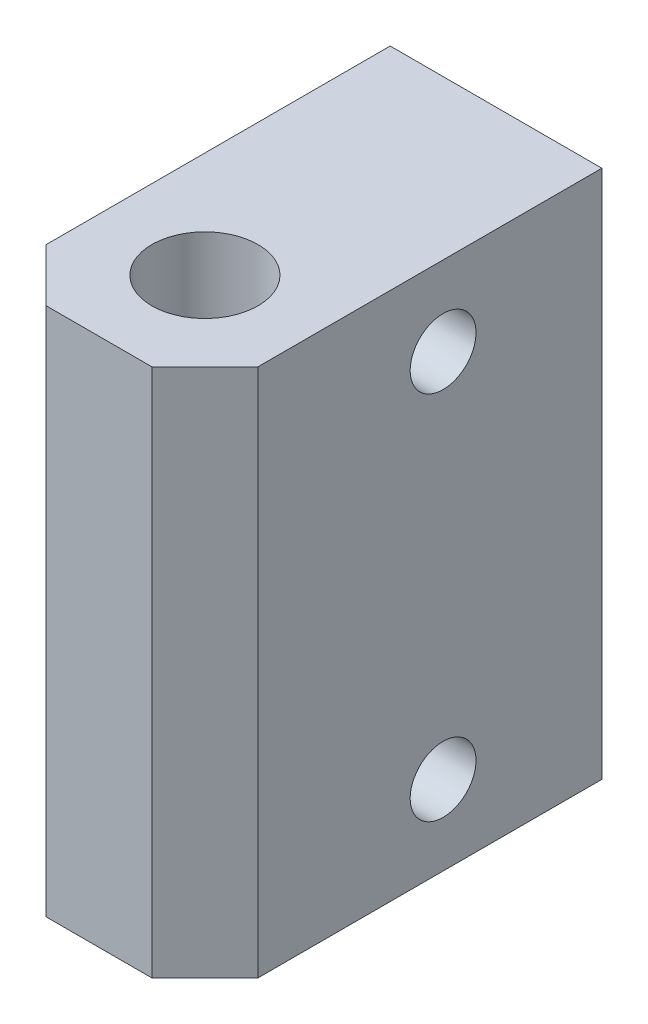
ISO-10303-21;
HEADER;
FILE_DESCRIPTION(('STEP AP214'),'2;1');
FILE_NAME('part.step','',(''),(''),'','','');
FILE_SCHEMA(('AUTOMOTIVE_DESIGN { 1 0 10303 214 1 1 1 1 }'));
ENDSEC;
DATA;
#1=APPLICATION_CONTEXT('core data for automotive mechanical design processes');
#2=APPLICATION_PROTOCOL_DEFINITION('international standard','automotive_design',2000,#1);
#3=PRODUCT_CONTEXT('',#1,'mechanical');
#4=PRODUCT('Part','Part','',(#3));
#5=PRODUCT_RELATED_PRODUCT_CATEGORY('part','',(#4));
#6=PRODUCT_DEFINITION_FORMATION('','',#4);
#7=PRODUCT_DEFINITION_CONTEXT('part definition',#1,'design');
#8=PRODUCT_DEFINITION('design','',#6,#7);
#9=PRODUCT_DEFINITION_SHAPE('','',#8);
#10=(LENGTH_UNIT() NAMED_UNIT(*) SI_UNIT(.MILLI.,.METRE.));
#11=(NAMED_UNIT(*) PLANE_ANGLE_UNIT() SI_UNIT($,.RADIAN.));
#12=(NAMED_UNIT(*) SI_UNIT($,.STERADIAN.) SOLID_ANGLE_UNIT());
#13=UNCERTAINTY_MEASURE_WITH_UNIT(LENGTH_MEASURE(1.E-05),#10,'distance_accuracy_value','');
#14=(GEOMETRIC_REPRESENTATION_CONTEXT(3) GLOBAL_UNCERTAINTY_ASSIGNED_CONTEXT((#13)) GLOBAL_UNIT_ASSIGNED_CONTEXT((#10,
#11,#12)) REPRESENTATION_CONTEXT('',''));
#15=CARTESIAN_POINT('',(0.,0.,0.));
#16=DIRECTION('',(0.,0.,1.));
#17=DIRECTION('',(1.,0.,0.));
#18=AXIS2_PLACEMENT_3D('',#15,#16,#17);
#19=CARTESIAN_POINT('',(8.,40.,8.));
#20=DIRECTION('',(-1.,0.,0.));
#21=DIRECTION('',(0.,0.,1.));
#22=AXIS2_PLACEMENT_3D('',#19,#20,#21);
#23=PLANE('',#22);
#24=CARTESIAN_POINT('',(8.,34.,-10.));
#25=DIRECTION('',(-1.,0.,0.));
#26=DIRECTION('',(0.,0.,1.));
#27=AXIS2_PLACEMENT_3D('',#24,#25,#26);
#28=CIRCLE('',#27,2.4892);
#29=CARTESIAN_POINT('',(8.,34.,-7.51080000000001));
#30=VERTEX_POINT('',#29);
#31=EDGE_CURVE('E268',#30,#30,#28,.T.);
#32=ORIENTED_EDGE('',*,*,#31,.T.);
#33=EDGE_LOOP('',(#32));
#34=FACE_BOUND('',#33,.T.);
#35=CARTESIAN_POINT('',(8.,6.,-10.));
#36=DIRECTION('',(-1.,0.,0.));
#37=DIRECTION('',(0.,0.,1.));
#38=AXIS2_PLACEMENT_3D('',#35,#36,#37);
#39=CIRCLE('',#38,2.4892);
#40=CARTESIAN_POINT('',(8.,6.,-7.51080000000001));
#41=VERTEX_POINT('',#40);
#42=EDGE_CURVE('E106',#41,#41,#39,.T.);
#43=ORIENTED_EDGE('',*,*,#42,.T.);
#44=EDGE_LOOP('',(#43));
#45=FACE_BOUND('',#44,.T.);
#46=DIRECTION('',(0.,0.,-1.));
#47=VECTOR('',#46,1.);
#48=CARTESIAN_POINT('',(8.,40.,8.));
#49=LINE('',#48,#47);
#50=CARTESIAN_POINT('',(8.,40.,3.99999999999999));
#51=VERTEX_POINT('',#50);
#52=CARTESIAN_POINT('',(8.,40.,-22.));
#53=VERTEX_POINT('',#52);
#54=EDGE_CURVE('E110',#51,#53,#49,.T.);
#55=ORIENTED_EDGE('',*,*,#54,.F.);
#56=DIRECTION('',(0.,-1.,0.));
#57=VECTOR('',#56,1.);
#58=CARTESIAN_POINT('',(8.,40.,3.99999999999999));
#59=LINE('',#58,#57);
#60=CARTESIAN_POINT('',(8.,0.,3.99999999999999));
#61=VERTEX_POINT('',#60);
#62=EDGE_CURVE('E129',#51,#61,#59,.T.);
#63=ORIENTED_EDGE('',*,*,#62,.T.);
#64=DIRECTION('',(0.,0.,-1.));
#65=VECTOR('',#64,1.);
#66=CARTESIAN_POINT('',(8.,0.,8.));
#67=LINE('',#66,#65);
#68=CARTESIAN_POINT('',(8.,0.,-22.));
#69=VERTEX_POINT('',#68);
#70=EDGE_CURVE('E100',#61,#69,#67,.T.);
#71=ORIENTED_EDGE('',*,*,#70,.T.);
#72=DIRECTION('',(0.,-1.,0.));
#73=VECTOR('',#72,1.);
#74=CARTESIAN_POINT('',(8.,40.,-22.));
#75=LINE('',#74,#73);
#76=EDGE_CURVE('E126',#53,#69,#75,.T.);
#77=ORIENTED_EDGE('',*,*,#76,.F.);
#78=EDGE_LOOP('',(#55,#63,#71,#77));
#79=FACE_BOUND('',#78,.T.);
#80=ADVANCED_FACE('F34',(#34,#45,#79),#23,.F.);
#81=CARTESIAN_POINT('',(-8.,40.,-22.));
#82=DIRECTION('',(0.,0.,1.));
#83=DIRECTION('',(1.,0.,0.));
#84=AXIS2_PLACEMENT_3D('',#81,#82,#83);
#85=PLANE('',#84);
#86=DIRECTION('',(-1.,0.,0.));
#87=VECTOR('',#86,1.);
#88=CARTESIAN_POINT('',(-8.,0.,-22.));
#89=LINE('',#88,#87);
#90=CARTESIAN_POINT('',(-8.,0.,-22.));
#91=VERTEX_POINT('',#90);
#92=EDGE_CURVE('E103',#69,#91,#89,.T.);
#93=ORIENTED_EDGE('',*,*,#92,.T.);
#94=DIRECTION('',(0.,-1.,0.));
#95=VECTOR('',#94,1.);
#96=CARTESIAN_POINT('',(-8.,40.,-22.));
#97=LINE('',#96,#95);
#98=CARTESIAN_POINT('',(-8.,40.,-22.));
#99=VERTEX_POINT('',#98);
#100=EDGE_CURVE('E118',#99,#91,#97,.T.);
#101=ORIENTED_EDGE('',*,*,#100,.F.);
#102=DIRECTION('',(-1.,0.,0.));
#103=VECTOR('',#102,1.);
#104=CARTESIAN_POINT('',(-8.,40.,-22.));
#105=LINE('',#104,#103);
#106=EDGE_CURVE('E112',#53,#99,#105,.T.);
#107=ORIENTED_EDGE('',*,*,#106,.F.);
#108=ORIENTED_EDGE('',*,*,#76,.T.);
#109=EDGE_LOOP('',(#93,#101,#107,#108));
#110=FACE_BOUND('',#109,.T.);
#111=ADVANCED_FACE('F163',(#110),#85,.F.);
#112=CARTESIAN_POINT('',(-8.,40.,8.));
#113=DIRECTION('',(1.,0.,0.));
#114=DIRECTION('',(0.,0.,-1.));
#115=AXIS2_PLACEMENT_3D('',#112,#113,#114);
#116=PLANE('',#115);
#117=CARTESIAN_POINT('',(-8.,34.,-10.));
#118=DIRECTION('',(-1.,0.,0.));
#119=DIRECTION('',(0.,0.,1.));
#120=AXIS2_PLACEMENT_3D('',#117,#118,#119);
#121=CIRCLE('',#120,2.48919999999999);
#122=CARTESIAN_POINT('',(-8.,34.,-7.51080000000001));
#123=VERTEX_POINT('',#122);
#124=EDGE_CURVE('E271',#123,#123,#121,.T.);
#125=ORIENTED_EDGE('',*,*,#124,.F.);
#126=EDGE_LOOP('',(#125));
#127=FACE_BOUND('',#126,.T.);
#128=CARTESIAN_POINT('',(-8.,6.,-10.));
#129=DIRECTION('',(-1.,0.,0.));
#130=DIRECTION('',(0.,0.,1.));
#131=AXIS2_PLACEMENT_3D('',#128,#129,#130);
#132=CIRCLE('',#131,2.48919999999999);
#133=CARTESIAN_POINT('',(-8.,6.,-7.51080000000001));
#134=VERTEX_POINT('',#133);
#135=EDGE_CURVE('E273',#134,#134,#132,.T.);
#136=ORIENTED_EDGE('',*,*,#135,.F.);
#137=EDGE_LOOP('',(#136));
#138=FACE_BOUND('',#137,.T.);
#139=DIRECTION('',(0.,0.,1.));
#140=VECTOR('',#139,1.);
#141=CARTESIAN_POINT('',(-8.,0.,8.));
#142=LINE('',#141,#140);
#143=CARTESIAN_POINT('',(-8.,0.,3.99999999999998));
#144=VERTEX_POINT('',#143);
#145=EDGE_CURVE('E121',#91,#144,#142,.T.);
#146=ORIENTED_EDGE('',*,*,#145,.T.);
#147=DIRECTION('',(0.,1.,0.));
#148=VECTOR('',#147,1.);
#149=CARTESIAN_POINT('',(-8.,40.,3.99999999999998));
#150=LINE('',#149,#148);
#151=CARTESIAN_POINT('',(-8.,40.,3.99999999999998));
#152=VERTEX_POINT('',#151);
#153=EDGE_CURVE('E11',#144,#152,#150,.T.);
#154=ORIENTED_EDGE('',*,*,#153,.T.);
#155=DIRECTION('',(0.,0.,1.));
#156=VECTOR('',#155,1.);
#157=CARTESIAN_POINT('',(-8.,40.,8.));
#158=LINE('',#157,#156);
#159=EDGE_CURVE('E115',#99,#152,#158,.T.);
#160=ORIENTED_EDGE('',*,*,#159,.F.);
#161=ORIENTED_EDGE('',*,*,#100,.T.);
#162=EDGE_LOOP('',(#146,#154,#160,#161));
#163=FACE_BOUND('',#162,.T.);
#164=ADVANCED_FACE('F160',(#127,#138,#163),#116,.F.);
#165=CARTESIAN_POINT('',(-8.,40.,8.));
#166=DIRECTION('',(0.,0.,-1.));
#167=DIRECTION('',(-1.,0.,0.));
#168=AXIS2_PLACEMENT_3D('',#165,#166,#167);
#169=PLANE('',#168);
#170=DIRECTION('',(1.,0.,0.));
#171=VECTOR('',#170,1.);
#172=CARTESIAN_POINT('',(-8.,0.,8.));
#173=LINE('',#172,#171);
#174=CARTESIAN_POINT('',(-3.99999999999999,0.,8.));
#175=VERTEX_POINT('',#174);
#176=CARTESIAN_POINT('',(3.99999999999998,0.,8.));
#177=VERTEX_POINT('',#176);
#178=EDGE_CURVE('E113',#175,#177,#173,.T.);
#179=ORIENTED_EDGE('',*,*,#178,.T.);
#180=DIRECTION('',(0.,1.,0.));
#181=VECTOR('',#180,1.);
#182=CARTESIAN_POINT('',(3.99999999999998,40.,8.));
#183=LINE('',#182,#181);
#184=CARTESIAN_POINT('',(3.99999999999998,40.,8.));
#185=VERTEX_POINT('',#184);
#186=EDGE_CURVE('E55',#177,#185,#183,.T.);
#187=ORIENTED_EDGE('',*,*,#186,.T.);
#188=DIRECTION('',(1.,0.,0.));
#189=VECTOR('',#188,1.);
#190=CARTESIAN_POINT('',(-8.,40.,8.));
#191=LINE('',#190,#189);
#192=CARTESIAN_POINT('',(-3.99999999999999,40.,8.));
#193=VERTEX_POINT('',#192);
#194=EDGE_CURVE('E117',#193,#185,#191,.T.);
#195=ORIENTED_EDGE('',*,*,#194,.F.);
#196=DIRECTION('',(0.,-1.,0.));
#197=VECTOR('',#196,1.);
#198=CARTESIAN_POINT('',(-3.99999999999999,40.,8.));
#199=LINE('',#198,#197);
#200=EDGE_CURVE('E136',#193,#175,#199,.T.);
#201=ORIENTED_EDGE('',*,*,#200,.T.);
#202=EDGE_LOOP('',(#179,#187,#195,#201));
#203=FACE_BOUND('',#202,.T.);
#204=ADVANCED_FACE('F155',(#203),#169,.F.);
#205=CARTESIAN_POINT('',(0.,40.,0.));
#206=DIRECTION('',(0.,-1.,0.));
#207=DIRECTION('',(0.,0.,-1.));
#208=AXIS2_PLACEMENT_3D('',#205,#206,#207);
#209=PLANE('',#208);
#210=CARTESIAN_POINT('',(0.,40.,0.));
#211=DIRECTION('',(0.,1.,0.));
#212=DIRECTION('',(0.,0.,1.));
#213=AXIS2_PLACEMENT_3D('',#210,#211,#212);
#214=CIRCLE('',#213,4.0132);
#215=CARTESIAN_POINT('',(0.,40.,4.0132));
#216=VERTEX_POINT('',#215);
#217=EDGE_CURVE('E101',#216,#216,#214,.T.);
#218=ORIENTED_EDGE('',*,*,#217,.F.);
#219=EDGE_LOOP('',(#218));
#220=FACE_BOUND('',#219,.T.);
#221=ORIENTED_EDGE('',*,*,#194,.T.);
#222=DIRECTION('',(-0.707106781186548,0.,0.707106781186547));
#223=VECTOR('',#222,1.);
#224=CARTESIAN_POINT('',(8.,40.,3.99999999999999));
#225=LINE('',#224,#223);
#226=EDGE_CURVE('E42',#185,#51,#225,.F.);
#227=ORIENTED_EDGE('',*,*,#226,.T.);
#228=ORIENTED_EDGE('',*,*,#54,.T.);
#229=ORIENTED_EDGE('',*,*,#106,.T.);
#230=ORIENTED_EDGE('',*,*,#159,.T.);
#231=DIRECTION('',(-0.707106781186547,0.,-0.707106781186548));
#232=VECTOR('',#231,1.);
#233=CARTESIAN_POINT('',(-3.99999999999999,40.,8.));
#234=LINE('',#233,#232);
#235=EDGE_CURVE('E140',#152,#193,#234,.F.);
#236=ORIENTED_EDGE('',*,*,#235,.T.);
#237=EDGE_LOOP('',(#221,#227,#228,#229,#230,#236));
#238=FACE_BOUND('',#237,.T.);
#239=ADVANCED_FACE('F144',(#220,#238),#209,.F.);
#240=CARTESIAN_POINT('',(0.,0.,0.));
#241=DIRECTION('',(0.,-1.,0.));
#242=DIRECTION('',(0.,0.,-1.));
#243=AXIS2_PLACEMENT_3D('',#240,#241,#242);
#244=PLANE('',#243);
#245=ORIENTED_EDGE('',*,*,#70,.F.);
#246=DIRECTION('',(0.707106781186548,0.,-0.707106781186547));
#247=VECTOR('',#246,1.);
#248=CARTESIAN_POINT('',(5.99999999999999,0.,6.));
#249=LINE('',#248,#247);
#250=EDGE_CURVE('E134',#61,#177,#249,.F.);
#251=ORIENTED_EDGE('',*,*,#250,.T.);
#252=ORIENTED_EDGE('',*,*,#178,.F.);
#253=DIRECTION('',(0.707106781186547,0.,0.707106781186548));
#254=VECTOR('',#253,1.);
#255=CARTESIAN_POINT('',(-6.,0.,5.99999999999999));
#256=LINE('',#255,#254);
#257=EDGE_CURVE('E132',#175,#144,#256,.F.);
#258=ORIENTED_EDGE('',*,*,#257,.T.);
#259=ORIENTED_EDGE('',*,*,#145,.F.);
#260=ORIENTED_EDGE('',*,*,#92,.F.);
#261=EDGE_LOOP('',(#245,#251,#252,#258,#259,#260));
#262=FACE_BOUND('',#261,.T.);
#263=ADVANCED_FACE('F94',(#262),#244,.T.);
#264=CARTESIAN_POINT('',(0.,25.,0.));
#265=DIRECTION('',(0.,1.,0.));
#266=DIRECTION('',(0.,0.,1.));
#267=AXIS2_PLACEMENT_3D('',#264,#265,#266);
#268=CONICAL_SURFACE('',#267,4.0132,1.02974425867665);
#269=CARTESIAN_POINT('',(0.,22.5886261637186,0.));
#270=VERTEX_POINT('',#269);
#271=VERTEX_LOOP('',#270);
#272=FACE_BOUND('',#271,.T.);
#273=CARTESIAN_POINT('',(0.,25.,0.));
#274=DIRECTION('',(0.,1.,0.));
#275=DIRECTION('',(0.,0.,1.));
#276=AXIS2_PLACEMENT_3D('',#273,#274,#275);
#277=CIRCLE('',#276,4.0132);
#278=CARTESIAN_POINT('',(0.,25.,4.0132));
#279=VERTEX_POINT('',#278);
#280=EDGE_CURVE('E98',#279,#279,#277,.T.);
#281=ORIENTED_EDGE('',*,*,#280,.T.);
#282=EDGE_LOOP('',(#281));
#283=FACE_BOUND('',#282,.T.);
#284=ADVANCED_FACE('F90',(#272,#283),#268,.F.);
#285=CARTESIAN_POINT('',(0.,40.,0.));
#286=DIRECTION('',(0.,1.,0.));
#287=DIRECTION('',(0.,0.,1.));
#288=AXIS2_PLACEMENT_3D('',#285,#286,#287);
#289=CYLINDRICAL_SURFACE('',#288,4.0132);
#290=ORIENTED_EDGE('',*,*,#280,.F.);
#291=EDGE_LOOP('',(#290));
#292=FACE_BOUND('',#291,.T.);
#293=ORIENTED_EDGE('',*,*,#217,.T.);
#294=EDGE_LOOP('',(#293));
#295=FACE_BOUND('',#294,.T.);
#296=ADVANCED_FACE('F93',(#292,#295),#289,.F.);
#297=CARTESIAN_POINT('',(-8.,6.,-10.));
#298=DIRECTION('',(-1.,0.,0.));
#299=DIRECTION('',(0.,0.,1.));
#300=AXIS2_PLACEMENT_3D('',#297,#298,#299);
#301=CYLINDRICAL_SURFACE('',#300,2.48919999999999);
#302=ORIENTED_EDGE('',*,*,#42,.F.);
#303=EDGE_LOOP('',(#302));
#304=FACE_BOUND('',#303,.T.);
#305=ORIENTED_EDGE('',*,*,#135,.T.);
#306=EDGE_LOOP('',(#305));
#307=FACE_BOUND('',#306,.T.);
#308=ADVANCED_FACE('F181',(#304,#307),#301,.F.);
#309=CARTESIAN_POINT('',(-8.,34.,-10.));
#310=DIRECTION('',(-1.,0.,0.));
#311=DIRECTION('',(0.,0.,1.));
#312=AXIS2_PLACEMENT_3D('',#309,#310,#311);
#313=CYLINDRICAL_SURFACE('',#312,2.48919999999999);
#314=ORIENTED_EDGE('',*,*,#31,.F.);
#315=EDGE_LOOP('',(#314));
#316=FACE_BOUND('',#315,.T.);
#317=ORIENTED_EDGE('',*,*,#124,.T.);
#318=EDGE_LOOP('',(#317));
#319=FACE_BOUND('',#318,.T.);
#320=ADVANCED_FACE('F176',(#316,#319),#313,.F.);
#321=CARTESIAN_POINT('',(8.,40.,3.99999999999999));
#322=DIRECTION('',(-0.707106781186547,0.,-0.707106781186548));
#323=DIRECTION('',(0.,-1.,0.));
#324=AXIS2_PLACEMENT_3D('',#321,#322,#323);
#325=PLANE('',#324);
#326=ORIENTED_EDGE('',*,*,#226,.F.);
#327=ORIENTED_EDGE('',*,*,#186,.F.);
#328=ORIENTED_EDGE('',*,*,#250,.F.);
#329=ORIENTED_EDGE('',*,*,#62,.F.);
#330=EDGE_LOOP('',(#326,#327,#328,#329));
#331=FACE_BOUND('',#330,.T.);
#332=ADVANCED_FACE('F151',(#331),#325,.F.);
#333=CARTESIAN_POINT('',(-3.99999999999999,40.,8.));
#334=DIRECTION('',(0.707106781186548,0.,-0.707106781186547));
#335=DIRECTION('',(0.,-1.,0.));
#336=AXIS2_PLACEMENT_3D('',#333,#334,#335);
#337=PLANE('',#336);
#338=ORIENTED_EDGE('',*,*,#235,.F.);
#339=ORIENTED_EDGE('',*,*,#153,.F.);
#340=ORIENTED_EDGE('',*,*,#257,.F.);
#341=ORIENTED_EDGE('',*,*,#200,.F.);
#342=EDGE_LOOP('',(#338,#339,#340,#341));
#343=FACE_BOUND('',#342,.T.);
#344=ADVANCED_FACE('F36',(#343),#337,.F.);
#345=CLOSED_SHELL('',(#80,#111,#164,#204,#239,#263,#284,#296,#308,#320,#332,#344));
#346=MANIFOLD_SOLID_BREP('B2',#345);
#347=ADVANCED_BREP_SHAPE_REPRESENTATION('',(#18,#346),#14);
#348=SHAPE_DEFINITION_REPRESENTATION(#9,#347);
ENDSEC;
END-ISO-10303-21;
